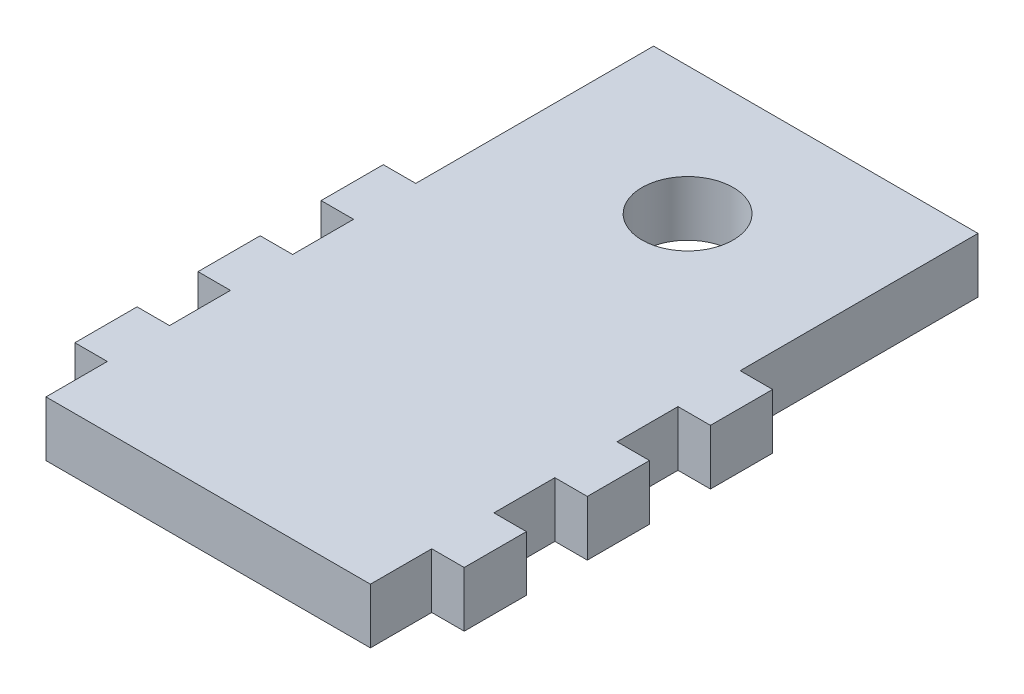
ISO-10303-21;
HEADER;
FILE_DESCRIPTION(('STEP AP214'),'2;1');
FILE_NAME('part.step','',(''),(''),'','','');
FILE_SCHEMA(('AUTOMOTIVE_DESIGN { 1 0 10303 214 1 1 1 1 }'));
ENDSEC;
DATA;
#1=APPLICATION_CONTEXT('core data for automotive mechanical design processes');
#2=APPLICATION_PROTOCOL_DEFINITION('international standard','automotive_design',2000,#1);
#3=PRODUCT_CONTEXT('',#1,'mechanical');
#4=PRODUCT('Part','Part','',(#3));
#5=PRODUCT_RELATED_PRODUCT_CATEGORY('part','',(#4));
#6=PRODUCT_DEFINITION_FORMATION('','',#4);
#7=PRODUCT_DEFINITION_CONTEXT('part definition',#1,'design');
#8=PRODUCT_DEFINITION('design','',#6,#7);
#9=PRODUCT_DEFINITION_SHAPE('','',#8);
#10=(LENGTH_UNIT() NAMED_UNIT(*) SI_UNIT(.MILLI.,.METRE.));
#11=(NAMED_UNIT(*) PLANE_ANGLE_UNIT() SI_UNIT($,.RADIAN.));
#12=(NAMED_UNIT(*) SI_UNIT($,.STERADIAN.) SOLID_ANGLE_UNIT());
#13=UNCERTAINTY_MEASURE_WITH_UNIT(LENGTH_MEASURE(1.E-05),#10,'distance_accuracy_value','');
#14=(GEOMETRIC_REPRESENTATION_CONTEXT(3) GLOBAL_UNCERTAINTY_ASSIGNED_CONTEXT((#13)) GLOBAL_UNIT_ASSIGNED_CONTEXT((#10,
#11,#12)) REPRESENTATION_CONTEXT('',''));
#15=CARTESIAN_POINT('',(0.,0.,0.));
#16=DIRECTION('',(0.,0.,1.));
#17=DIRECTION('',(1.,0.,0.));
#18=AXIS2_PLACEMENT_3D('',#15,#16,#17);
#19=CARTESIAN_POINT('',(-3.49862647297686,-70.5851324917423,-17.2482956808851));
#20=DIRECTION('',(0.,1.,0.));
#21=DIRECTION('',(0.,0.,1.));
#22=AXIS2_PLACEMENT_3D('',#19,#20,#21);
#23=CYLINDRICAL_SURFACE('',#22,4.45936);
#24=CARTESIAN_POINT('',(-3.49862647297686,0.,-17.2482956808851));
#25=DIRECTION('',(0.,1.,0.));
#26=DIRECTION('',(0.,0.,1.));
#27=AXIS2_PLACEMENT_3D('',#24,#25,#26);
#28=CIRCLE('',#27,4.45936);
#29=CARTESIAN_POINT('',(-3.49862647297686,0.,-12.7889356808851));
#30=VERTEX_POINT('',#29);
#31=EDGE_CURVE('E11',#30,#30,#28,.F.);
#32=ORIENTED_EDGE('',*,*,#31,.T.);
#33=EDGE_LOOP('',(#32));
#34=FACE_BOUND('',#33,.T.);
#35=CARTESIAN_POINT('',(-3.49862647297686,5.4,-17.2482956808851));
#36=DIRECTION('',(0.,1.,0.));
#37=DIRECTION('',(0.,0.,1.));
#38=AXIS2_PLACEMENT_3D('',#35,#36,#37);
#39=CIRCLE('',#38,4.45936);
#40=CARTESIAN_POINT('',(-3.49862647297686,5.4,-12.7889356808851));
#41=VERTEX_POINT('',#40);
#42=EDGE_CURVE('E256',#41,#41,#39,.T.);
#43=ORIENTED_EDGE('',*,*,#42,.T.);
#44=EDGE_LOOP('',(#43));
#45=FACE_BOUND('',#44,.T.);
#46=ADVANCED_FACE('F41',(#34,#45),#23,.F.);
#47=CARTESIAN_POINT('',(0.,0.,0.));
#48=DIRECTION('',(0.,1.,0.));
#49=DIRECTION('',(0.,0.,1.));
#50=AXIS2_PLACEMENT_3D('',#47,#48,#49);
#51=PLANE('',#50);
#52=DIRECTION('',(1.,0.,0.));
#53=VECTOR('',#52,1.);
#54=CARTESIAN_POINT('',(15.5420135270232,0.,-6.5246499665994));
#55=LINE('',#54,#53);
#56=CARTESIAN_POINT('',(12.3670135270231,0.,-6.5246499665994));
#57=VERTEX_POINT('',#56);
#58=CARTESIAN_POINT('',(15.5420135270232,0.,-6.5246499665994));
#59=VERTEX_POINT('',#58);
#60=EDGE_CURVE('E59',#57,#59,#55,.T.);
#61=ORIENTED_EDGE('',*,*,#60,.T.);
#62=DIRECTION('',(0.,0.,1.));
#63=VECTOR('',#62,1.);
#64=CARTESIAN_POINT('',(15.5420135270232,0.,-0.443369966599398));
#65=LINE('',#64,#63);
#66=CARTESIAN_POINT('',(15.5420135270232,0.,-0.443369966599398));
#67=VERTEX_POINT('',#66);
#68=EDGE_CURVE('E513',#59,#67,#65,.T.);
#69=ORIENTED_EDGE('',*,*,#68,.T.);
#70=DIRECTION('',(-1.,0.,0.));
#71=VECTOR('',#70,1.);
#72=CARTESIAN_POINT('',(12.3670135270231,0.,-0.443369966599398));
#73=LINE('',#72,#71);
#74=CARTESIAN_POINT('',(12.3670135270231,0.,-0.443369966599398));
#75=VERTEX_POINT('',#74);
#76=EDGE_CURVE('E510',#67,#75,#73,.T.);
#77=ORIENTED_EDGE('',*,*,#76,.T.);
#78=DIRECTION('',(0.,0.,1.));
#79=VECTOR('',#78,1.);
#80=CARTESIAN_POINT('',(12.3670135270231,0.,5.51820717625773));
#81=LINE('',#80,#79);
#82=CARTESIAN_POINT('',(12.3670135270231,0.,5.51820717625773));
#83=VERTEX_POINT('',#82);
#84=EDGE_CURVE('E507',#75,#83,#81,.T.);
#85=ORIENTED_EDGE('',*,*,#84,.T.);
#86=DIRECTION('',(1.,0.,0.));
#87=VECTOR('',#86,1.);
#88=CARTESIAN_POINT('',(15.5420135270232,0.,5.51820717625773));
#89=LINE('',#88,#87);
#90=CARTESIAN_POINT('',(15.5420135270232,0.,5.51820717625773));
#91=VERTEX_POINT('',#90);
#92=EDGE_CURVE('E504',#83,#91,#89,.T.);
#93=ORIENTED_EDGE('',*,*,#92,.T.);
#94=DIRECTION('',(0.,0.,1.));
#95=VECTOR('',#94,1.);
#96=CARTESIAN_POINT('',(15.5420135270232,0.,11.5994871762577));
#97=LINE('',#96,#95);
#98=CARTESIAN_POINT('',(15.5420135270232,0.,11.5994871762577));
#99=VERTEX_POINT('',#98);
#100=EDGE_CURVE('E501',#91,#99,#97,.T.);
#101=ORIENTED_EDGE('',*,*,#100,.T.);
#102=DIRECTION('',(-1.,0.,0.));
#103=VECTOR('',#102,1.);
#104=CARTESIAN_POINT('',(12.3670135270231,0.,11.5994871762577));
#105=LINE('',#104,#103);
#106=CARTESIAN_POINT('',(12.3670135270231,0.,11.5994871762577));
#107=VERTEX_POINT('',#106);
#108=EDGE_CURVE('E498',#99,#107,#105,.T.);
#109=ORIENTED_EDGE('',*,*,#108,.T.);
#110=DIRECTION('',(0.,0.,1.));
#111=VECTOR('',#110,1.);
#112=CARTESIAN_POINT('',(12.3670135270231,0.,17.5610643191149));
#113=LINE('',#112,#111);
#114=CARTESIAN_POINT('',(12.3670135270231,0.,17.5610643191149));
#115=VERTEX_POINT('',#114);
#116=EDGE_CURVE('E495',#107,#115,#113,.T.);
#117=ORIENTED_EDGE('',*,*,#116,.T.);
#118=DIRECTION('',(1.,0.,0.));
#119=VECTOR('',#118,1.);
#120=CARTESIAN_POINT('',(15.5420135270231,0.,17.5610643191149));
#121=LINE('',#120,#119);
#122=CARTESIAN_POINT('',(15.5420135270231,0.,17.5610643191149));
#123=VERTEX_POINT('',#122);
#124=EDGE_CURVE('E492',#115,#123,#121,.T.);
#125=ORIENTED_EDGE('',*,*,#124,.T.);
#126=DIRECTION('',(0.,0.,1.));
#127=VECTOR('',#126,1.);
#128=CARTESIAN_POINT('',(15.5420135270231,0.,23.6423443191149));
#129=LINE('',#128,#127);
#130=CARTESIAN_POINT('',(15.5420135270231,0.,23.6423443191149));
#131=VERTEX_POINT('',#130);
#132=EDGE_CURVE('E489',#123,#131,#129,.T.);
#133=ORIENTED_EDGE('',*,*,#132,.T.);
#134=DIRECTION('',(-1.,0.,0.));
#135=VECTOR('',#134,1.);
#136=CARTESIAN_POINT('',(12.3670135270231,0.,23.6423443191149));
#137=LINE('',#136,#135);
#138=CARTESIAN_POINT('',(12.3670135270231,0.,23.6423443191149));
#139=VERTEX_POINT('',#138);
#140=EDGE_CURVE('E486',#131,#139,#137,.T.);
#141=ORIENTED_EDGE('',*,*,#140,.T.);
#142=DIRECTION('',(0.,0.,1.));
#143=VECTOR('',#142,1.);
#144=CARTESIAN_POINT('',(12.3670135270231,0.,29.6423443191149));
#145=LINE('',#144,#143);
#146=CARTESIAN_POINT('',(12.3670135270231,0.,29.6423443191149));
#147=VERTEX_POINT('',#146);
#148=EDGE_CURVE('E483',#139,#147,#145,.T.);
#149=ORIENTED_EDGE('',*,*,#148,.T.);
#150=DIRECTION('',(-1.,0.,0.));
#151=VECTOR('',#150,1.);
#152=CARTESIAN_POINT('',(-19.3642664729769,0.,29.6423443191149));
#153=LINE('',#152,#151);
#154=CARTESIAN_POINT('',(-19.3642664729769,0.,29.6423443191149));
#155=VERTEX_POINT('',#154);
#156=EDGE_CURVE('E480',#147,#155,#153,.T.);
#157=ORIENTED_EDGE('',*,*,#156,.T.);
#158=DIRECTION('',(0.,0.,-1.));
#159=VECTOR('',#158,1.);
#160=CARTESIAN_POINT('',(-19.3642664729769,0.,23.6423443191149));
#161=LINE('',#160,#159);
#162=CARTESIAN_POINT('',(-19.3642664729769,0.,23.6423443191149));
#163=VERTEX_POINT('',#162);
#164=EDGE_CURVE('E477',#155,#163,#161,.T.);
#165=ORIENTED_EDGE('',*,*,#164,.T.);
#166=DIRECTION('',(-1.,0.,0.));
#167=VECTOR('',#166,1.);
#168=CARTESIAN_POINT('',(-22.5392664729769,0.,23.6423443191149));
#169=LINE('',#168,#167);
#170=CARTESIAN_POINT('',(-22.5392664729769,0.,23.6423443191149));
#171=VERTEX_POINT('',#170);
#172=EDGE_CURVE('E474',#163,#171,#169,.T.);
#173=ORIENTED_EDGE('',*,*,#172,.T.);
#174=DIRECTION('',(0.,0.,-1.));
#175=VECTOR('',#174,1.);
#176=CARTESIAN_POINT('',(-22.5392664729769,0.,17.5610643191149));
#177=LINE('',#176,#175);
#178=CARTESIAN_POINT('',(-22.5392664729769,0.,17.5610643191149));
#179=VERTEX_POINT('',#178);
#180=EDGE_CURVE('E471',#171,#179,#177,.T.);
#181=ORIENTED_EDGE('',*,*,#180,.T.);
#182=DIRECTION('',(1.,0.,0.));
#183=VECTOR('',#182,1.);
#184=CARTESIAN_POINT('',(-19.3642664729769,0.,17.5610643191149));
#185=LINE('',#184,#183);
#186=CARTESIAN_POINT('',(-19.3642664729769,0.,17.5610643191149));
#187=VERTEX_POINT('',#186);
#188=EDGE_CURVE('E468',#179,#187,#185,.T.);
#189=ORIENTED_EDGE('',*,*,#188,.T.);
#190=DIRECTION('',(0.,0.,-1.));
#191=VECTOR('',#190,1.);
#192=CARTESIAN_POINT('',(-19.3642664729769,0.,11.5994871762578));
#193=LINE('',#192,#191);
#194=CARTESIAN_POINT('',(-19.3642664729769,0.,11.5994871762578));
#195=VERTEX_POINT('',#194);
#196=EDGE_CURVE('E465',#187,#195,#193,.T.);
#197=ORIENTED_EDGE('',*,*,#196,.T.);
#198=DIRECTION('',(-1.,0.,0.));
#199=VECTOR('',#198,1.);
#200=CARTESIAN_POINT('',(-22.5392664729769,0.,11.5994871762578));
#201=LINE('',#200,#199);
#202=CARTESIAN_POINT('',(-22.5392664729769,0.,11.5994871762578));
#203=VERTEX_POINT('',#202);
#204=EDGE_CURVE('E462',#195,#203,#201,.T.);
#205=ORIENTED_EDGE('',*,*,#204,.T.);
#206=DIRECTION('',(0.,0.,-1.));
#207=VECTOR('',#206,1.);
#208=CARTESIAN_POINT('',(-22.5392664729769,0.,5.51820717625776));
#209=LINE('',#208,#207);
#210=CARTESIAN_POINT('',(-22.5392664729769,0.,5.51820717625776));
#211=VERTEX_POINT('',#210);
#212=EDGE_CURVE('E459',#203,#211,#209,.T.);
#213=ORIENTED_EDGE('',*,*,#212,.T.);
#214=DIRECTION('',(1.,0.,0.));
#215=VECTOR('',#214,1.);
#216=CARTESIAN_POINT('',(-19.3642664729769,0.,5.51820717625776));
#217=LINE('',#216,#215);
#218=CARTESIAN_POINT('',(-19.3642664729769,0.,5.51820717625776));
#219=VERTEX_POINT('',#218);
#220=EDGE_CURVE('E456',#211,#219,#217,.T.);
#221=ORIENTED_EDGE('',*,*,#220,.T.);
#222=DIRECTION('',(0.,0.,-1.));
#223=VECTOR('',#222,1.);
#224=CARTESIAN_POINT('',(-19.3642664729769,0.,-0.443369966599384));
#225=LINE('',#224,#223);
#226=CARTESIAN_POINT('',(-19.3642664729769,0.,-0.443369966599384));
#227=VERTEX_POINT('',#226);
#228=EDGE_CURVE('E453',#219,#227,#225,.T.);
#229=ORIENTED_EDGE('',*,*,#228,.T.);
#230=DIRECTION('',(-1.,0.,0.));
#231=VECTOR('',#230,1.);
#232=CARTESIAN_POINT('',(-22.5392664729769,0.,-0.443369966599384));
#233=LINE('',#232,#231);
#234=CARTESIAN_POINT('',(-22.5392664729769,0.,-0.443369966599384));
#235=VERTEX_POINT('',#234);
#236=EDGE_CURVE('E450',#227,#235,#233,.T.);
#237=ORIENTED_EDGE('',*,*,#236,.T.);
#238=DIRECTION('',(0.,0.,-1.));
#239=VECTOR('',#238,1.);
#240=CARTESIAN_POINT('',(-22.5392664729769,0.,-6.52464996659939));
#241=LINE('',#240,#239);
#242=CARTESIAN_POINT('',(-22.5392664729769,0.,-6.52464996659939));
#243=VERTEX_POINT('',#242);
#244=EDGE_CURVE('E447',#235,#243,#241,.T.);
#245=ORIENTED_EDGE('',*,*,#244,.T.);
#246=DIRECTION('',(1.,0.,0.));
#247=VECTOR('',#246,1.);
#248=CARTESIAN_POINT('',(-19.3642664729769,0.,-6.52464996659939));
#249=LINE('',#248,#247);
#250=CARTESIAN_POINT('',(-19.3642664729769,0.,-6.52464996659939));
#251=VERTEX_POINT('',#250);
#252=EDGE_CURVE('E444',#243,#251,#249,.T.);
#253=ORIENTED_EDGE('',*,*,#252,.T.);
#254=DIRECTION('',(0.,0.,-1.));
#255=VECTOR('',#254,1.);
#256=CARTESIAN_POINT('',(-19.3642664729769,0.,-29.7889356808851));
#257=LINE('',#256,#255);
#258=CARTESIAN_POINT('',(-19.3642664729769,0.,-29.7889356808851));
#259=VERTEX_POINT('',#258);
#260=EDGE_CURVE('E138',#251,#259,#257,.T.);
#261=ORIENTED_EDGE('',*,*,#260,.T.);
#262=DIRECTION('',(1.,0.,0.));
#263=VECTOR('',#262,1.);
#264=CARTESIAN_POINT('',(12.3670135270231,0.,-29.7889356808851));
#265=LINE('',#264,#263);
#266=CARTESIAN_POINT('',(12.3670135270231,0.,-29.7889356808851));
#267=VERTEX_POINT('',#266);
#268=EDGE_CURVE('E142',#259,#267,#265,.T.);
#269=ORIENTED_EDGE('',*,*,#268,.T.);
#270=DIRECTION('',(0.,0.,1.));
#271=VECTOR('',#270,1.);
#272=CARTESIAN_POINT('',(12.3670135270231,0.,-6.5246499665994));
#273=LINE('',#272,#271);
#274=EDGE_CURVE('E51',#267,#57,#273,.T.);
#275=ORIENTED_EDGE('',*,*,#274,.T.);
#276=EDGE_LOOP('',(#61,#69,#77,#85,#93,#101,#109,#117,#125,#133,#141,#149,#157,#165,#173,#181,
#189,#197,#205,#213,#221,#229,#237,#245,#253,#261,#269,#275));
#277=FACE_BOUND('',#276,.T.);
#278=ORIENTED_EDGE('',*,*,#31,.F.);
#279=EDGE_LOOP('',(#278));
#280=FACE_BOUND('',#279,.T.);
#281=ADVANCED_FACE('F43',(#277,#280),#51,.F.);
#282=CARTESIAN_POINT('',(12.3670135270231,-70.5851324917423,-6.5246499665994));
#283=DIRECTION('',(1.,0.,0.));
#284=DIRECTION('',(0.,0.,-1.));
#285=AXIS2_PLACEMENT_3D('',#282,#283,#284);
#286=PLANE('',#285);
#287=ORIENTED_EDGE('',*,*,#274,.F.);
#288=DIRECTION('',(0.,1.,0.));
#289=VECTOR('',#288,1.);
#290=CARTESIAN_POINT('',(12.3670135270231,-70.5851324917423,-29.7889356808851));
#291=LINE('',#290,#289);
#292=CARTESIAN_POINT('',(12.3670135270231,5.4,-29.7889356808851));
#293=VERTEX_POINT('',#292);
#294=EDGE_CURVE('E241',#267,#293,#291,.T.);
#295=ORIENTED_EDGE('',*,*,#294,.T.);
#296=DIRECTION('',(0.,0.,-1.));
#297=VECTOR('',#296,1.);
#298=CARTESIAN_POINT('',(12.3670135270231,5.4,-6.5246499665994));
#299=LINE('',#298,#297);
#300=CARTESIAN_POINT('',(12.3670135270231,5.4,-6.5246499665994));
#301=VERTEX_POINT('',#300);
#302=EDGE_CURVE('E244',#301,#293,#299,.T.);
#303=ORIENTED_EDGE('',*,*,#302,.F.);
#304=DIRECTION('',(0.,1.,0.));
#305=VECTOR('',#304,1.);
#306=CARTESIAN_POINT('',(12.3670135270231,-70.5851324917423,-6.5246499665994));
#307=LINE('',#306,#305);
#308=EDGE_CURVE('E233',#57,#301,#307,.T.);
#309=ORIENTED_EDGE('',*,*,#308,.F.);
#310=EDGE_LOOP('',(#287,#295,#303,#309));
#311=FACE_BOUND('',#310,.T.);
#312=ADVANCED_FACE('F245',(#311),#286,.T.);
#313=CARTESIAN_POINT('',(12.3670135270231,-70.5851324917423,-29.7889356808851));
#314=DIRECTION('',(0.,0.,-1.));
#315=DIRECTION('',(-1.,0.,0.));
#316=AXIS2_PLACEMENT_3D('',#313,#314,#315);
#317=PLANE('',#316);
#318=ORIENTED_EDGE('',*,*,#268,.F.);
#319=DIRECTION('',(0.,1.,0.));
#320=VECTOR('',#319,1.);
#321=CARTESIAN_POINT('',(-19.3642664729769,-70.5851324917423,-29.7889356808851));
#322=LINE('',#321,#320);
#323=CARTESIAN_POINT('',(-19.3642664729769,5.4,-29.7889356808851));
#324=VERTEX_POINT('',#323);
#325=EDGE_CURVE('E436',#259,#324,#322,.T.);
#326=ORIENTED_EDGE('',*,*,#325,.T.);
#327=DIRECTION('',(-1.,0.,0.));
#328=VECTOR('',#327,1.);
#329=CARTESIAN_POINT('',(12.3670135270231,5.4,-29.7889356808851));
#330=LINE('',#329,#328);
#331=EDGE_CURVE('E250',#293,#324,#330,.T.);
#332=ORIENTED_EDGE('',*,*,#331,.F.);
#333=ORIENTED_EDGE('',*,*,#294,.F.);
#334=EDGE_LOOP('',(#318,#326,#332,#333));
#335=FACE_BOUND('',#334,.T.);
#336=ADVANCED_FACE('F552',(#335),#317,.T.);
#337=CARTESIAN_POINT('',(-19.3642664729769,-70.5851324917423,-29.7889356808851));
#338=DIRECTION('',(-1.,0.,0.));
#339=DIRECTION('',(0.,0.,1.));
#340=AXIS2_PLACEMENT_3D('',#337,#338,#339);
#341=PLANE('',#340);
#342=ORIENTED_EDGE('',*,*,#260,.F.);
#343=DIRECTION('',(0.,1.,0.));
#344=VECTOR('',#343,1.);
#345=CARTESIAN_POINT('',(-19.3642664729769,-70.5851324917423,-6.52464996659939));
#346=LINE('',#345,#344);
#347=CARTESIAN_POINT('',(-19.3642664729769,5.4,-6.52464996659939));
#348=VERTEX_POINT('',#347);
#349=EDGE_CURVE('E433',#251,#348,#346,.T.);
#350=ORIENTED_EDGE('',*,*,#349,.T.);
#351=DIRECTION('',(0.,0.,1.));
#352=VECTOR('',#351,1.);
#353=CARTESIAN_POINT('',(-19.3642664729769,5.4,-29.7889356808851));
#354=LINE('',#353,#352);
#355=EDGE_CURVE('E265',#324,#348,#354,.T.);
#356=ORIENTED_EDGE('',*,*,#355,.F.);
#357=ORIENTED_EDGE('',*,*,#325,.F.);
#358=EDGE_LOOP('',(#342,#350,#356,#357));
#359=FACE_BOUND('',#358,.T.);
#360=ADVANCED_FACE('F555',(#359),#341,.T.);
#361=CARTESIAN_POINT('',(-19.3642664729769,-70.5851324917423,-6.52464996659939));
#362=DIRECTION('',(0.,0.,-1.));
#363=DIRECTION('',(-1.,0.,0.));
#364=AXIS2_PLACEMENT_3D('',#361,#362,#363);
#365=PLANE('',#364);
#366=ORIENTED_EDGE('',*,*,#252,.F.);
#367=DIRECTION('',(0.,1.,0.));
#368=VECTOR('',#367,1.);
#369=CARTESIAN_POINT('',(-22.5392664729769,-70.5851324917423,-6.52464996659939));
#370=LINE('',#369,#368);
#371=CARTESIAN_POINT('',(-22.5392664729769,5.4,-6.52464996659939));
#372=VERTEX_POINT('',#371);
#373=EDGE_CURVE('E430',#243,#372,#370,.T.);
#374=ORIENTED_EDGE('',*,*,#373,.T.);
#375=DIRECTION('',(-1.,0.,0.));
#376=VECTOR('',#375,1.);
#377=CARTESIAN_POINT('',(-19.3642664729769,5.4,-6.52464996659939));
#378=LINE('',#377,#376);
#379=EDGE_CURVE('E269',#348,#372,#378,.T.);
#380=ORIENTED_EDGE('',*,*,#379,.F.);
#381=ORIENTED_EDGE('',*,*,#349,.F.);
#382=EDGE_LOOP('',(#366,#374,#380,#381));
#383=FACE_BOUND('',#382,.T.);
#384=ADVANCED_FACE('F559',(#383),#365,.T.);
#385=CARTESIAN_POINT('',(-22.5392664729769,-70.5851324917423,-6.52464996659939));
#386=DIRECTION('',(-1.,0.,0.));
#387=DIRECTION('',(0.,0.,1.));
#388=AXIS2_PLACEMENT_3D('',#385,#386,#387);
#389=PLANE('',#388);
#390=ORIENTED_EDGE('',*,*,#244,.F.);
#391=DIRECTION('',(0.,1.,0.));
#392=VECTOR('',#391,1.);
#393=CARTESIAN_POINT('',(-22.5392664729769,-70.5851324917423,-0.443369966599384));
#394=LINE('',#393,#392);
#395=CARTESIAN_POINT('',(-22.5392664729769,5.4,-0.443369966599384));
#396=VERTEX_POINT('',#395);
#397=EDGE_CURVE('E427',#235,#396,#394,.T.);
#398=ORIENTED_EDGE('',*,*,#397,.T.);
#399=DIRECTION('',(0.,0.,1.));
#400=VECTOR('',#399,1.);
#401=CARTESIAN_POINT('',(-22.5392664729769,5.4,-6.52464996659939));
#402=LINE('',#401,#400);
#403=EDGE_CURVE('E273',#372,#396,#402,.T.);
#404=ORIENTED_EDGE('',*,*,#403,.F.);
#405=ORIENTED_EDGE('',*,*,#373,.F.);
#406=EDGE_LOOP('',(#390,#398,#404,#405));
#407=FACE_BOUND('',#406,.T.);
#408=ADVANCED_FACE('F563',(#407),#389,.T.);
#409=CARTESIAN_POINT('',(-22.5392664729769,-70.5851324917423,-0.443369966599384));
#410=DIRECTION('',(0.,0.,1.));
#411=DIRECTION('',(1.,0.,0.));
#412=AXIS2_PLACEMENT_3D('',#409,#410,#411);
#413=PLANE('',#412);
#414=ORIENTED_EDGE('',*,*,#236,.F.);
#415=DIRECTION('',(0.,1.,0.));
#416=VECTOR('',#415,1.);
#417=CARTESIAN_POINT('',(-19.3642664729769,-70.5851324917423,-0.443369966599384));
#418=LINE('',#417,#416);
#419=CARTESIAN_POINT('',(-19.3642664729769,5.4,-0.443369966599384));
#420=VERTEX_POINT('',#419);
#421=EDGE_CURVE('E424',#227,#420,#418,.T.);
#422=ORIENTED_EDGE('',*,*,#421,.T.);
#423=DIRECTION('',(1.,0.,0.));
#424=VECTOR('',#423,1.);
#425=CARTESIAN_POINT('',(-22.5392664729769,5.4,-0.443369966599384));
#426=LINE('',#425,#424);
#427=EDGE_CURVE('E277',#396,#420,#426,.T.);
#428=ORIENTED_EDGE('',*,*,#427,.F.);
#429=ORIENTED_EDGE('',*,*,#397,.F.);
#430=EDGE_LOOP('',(#414,#422,#428,#429));
#431=FACE_BOUND('',#430,.T.);
#432=ADVANCED_FACE('F567',(#431),#413,.T.);
#433=CARTESIAN_POINT('',(-19.3642664729769,-70.5851324917423,-0.443369966599384));
#434=DIRECTION('',(-1.,0.,0.));
#435=DIRECTION('',(0.,0.,1.));
#436=AXIS2_PLACEMENT_3D('',#433,#434,#435);
#437=PLANE('',#436);
#438=ORIENTED_EDGE('',*,*,#228,.F.);
#439=DIRECTION('',(0.,1.,0.));
#440=VECTOR('',#439,1.);
#441=CARTESIAN_POINT('',(-19.3642664729769,-70.5851324917423,5.51820717625776));
#442=LINE('',#441,#440);
#443=CARTESIAN_POINT('',(-19.3642664729769,5.4,5.51820717625776));
#444=VERTEX_POINT('',#443);
#445=EDGE_CURVE('E421',#219,#444,#442,.T.);
#446=ORIENTED_EDGE('',*,*,#445,.T.);
#447=DIRECTION('',(0.,0.,1.));
#448=VECTOR('',#447,1.);
#449=CARTESIAN_POINT('',(-19.3642664729769,5.4,-0.443369966599384));
#450=LINE('',#449,#448);
#451=EDGE_CURVE('E281',#420,#444,#450,.T.);
#452=ORIENTED_EDGE('',*,*,#451,.F.);
#453=ORIENTED_EDGE('',*,*,#421,.F.);
#454=EDGE_LOOP('',(#438,#446,#452,#453));
#455=FACE_BOUND('',#454,.T.);
#456=ADVANCED_FACE('F571',(#455),#437,.T.);
#457=CARTESIAN_POINT('',(-19.3642664729769,-70.5851324917423,5.51820717625776));
#458=DIRECTION('',(0.,0.,-1.));
#459=DIRECTION('',(-1.,0.,0.));
#460=AXIS2_PLACEMENT_3D('',#457,#458,#459);
#461=PLANE('',#460);
#462=ORIENTED_EDGE('',*,*,#220,.F.);
#463=DIRECTION('',(0.,1.,0.));
#464=VECTOR('',#463,1.);
#465=CARTESIAN_POINT('',(-22.5392664729769,-70.5851324917423,5.51820717625776));
#466=LINE('',#465,#464);
#467=CARTESIAN_POINT('',(-22.5392664729769,5.4,5.51820717625776));
#468=VERTEX_POINT('',#467);
#469=EDGE_CURVE('E418',#211,#468,#466,.T.);
#470=ORIENTED_EDGE('',*,*,#469,.T.);
#471=DIRECTION('',(-1.,0.,0.));
#472=VECTOR('',#471,1.);
#473=CARTESIAN_POINT('',(-19.3642664729769,5.4,5.51820717625776));
#474=LINE('',#473,#472);
#475=EDGE_CURVE('E285',#444,#468,#474,.T.);
#476=ORIENTED_EDGE('',*,*,#475,.F.);
#477=ORIENTED_EDGE('',*,*,#445,.F.);
#478=EDGE_LOOP('',(#462,#470,#476,#477));
#479=FACE_BOUND('',#478,.T.);
#480=ADVANCED_FACE('F575',(#479),#461,.T.);
#481=CARTESIAN_POINT('',(-22.5392664729769,-70.5851324917423,5.51820717625776));
#482=DIRECTION('',(-1.,0.,0.));
#483=DIRECTION('',(0.,0.,1.));
#484=AXIS2_PLACEMENT_3D('',#481,#482,#483);
#485=PLANE('',#484);
#486=ORIENTED_EDGE('',*,*,#212,.F.);
#487=DIRECTION('',(0.,1.,0.));
#488=VECTOR('',#487,1.);
#489=CARTESIAN_POINT('',(-22.5392664729769,-70.5851324917423,11.5994871762578));
#490=LINE('',#489,#488);
#491=CARTESIAN_POINT('',(-22.5392664729769,5.4,11.5994871762578));
#492=VERTEX_POINT('',#491);
#493=EDGE_CURVE('E415',#203,#492,#490,.T.);
#494=ORIENTED_EDGE('',*,*,#493,.T.);
#495=DIRECTION('',(0.,0.,1.));
#496=VECTOR('',#495,1.);
#497=CARTESIAN_POINT('',(-22.5392664729769,5.4,5.51820717625776));
#498=LINE('',#497,#496);
#499=EDGE_CURVE('E289',#468,#492,#498,.T.);
#500=ORIENTED_EDGE('',*,*,#499,.F.);
#501=ORIENTED_EDGE('',*,*,#469,.F.);
#502=EDGE_LOOP('',(#486,#494,#500,#501));
#503=FACE_BOUND('',#502,.T.);
#504=ADVANCED_FACE('F579',(#503),#485,.T.);
#505=CARTESIAN_POINT('',(-22.5392664729769,-70.5851324917423,11.5994871762578));
#506=DIRECTION('',(0.,0.,1.));
#507=DIRECTION('',(1.,0.,0.));
#508=AXIS2_PLACEMENT_3D('',#505,#506,#507);
#509=PLANE('',#508);
#510=ORIENTED_EDGE('',*,*,#204,.F.);
#511=DIRECTION('',(0.,1.,0.));
#512=VECTOR('',#511,1.);
#513=CARTESIAN_POINT('',(-19.3642664729769,-70.5851324917423,11.5994871762578));
#514=LINE('',#513,#512);
#515=CARTESIAN_POINT('',(-19.3642664729769,5.4,11.5994871762578));
#516=VERTEX_POINT('',#515);
#517=EDGE_CURVE('E412',#195,#516,#514,.T.);
#518=ORIENTED_EDGE('',*,*,#517,.T.);
#519=DIRECTION('',(1.,0.,0.));
#520=VECTOR('',#519,1.);
#521=CARTESIAN_POINT('',(-22.5392664729769,5.4,11.5994871762578));
#522=LINE('',#521,#520);
#523=EDGE_CURVE('E293',#492,#516,#522,.T.);
#524=ORIENTED_EDGE('',*,*,#523,.F.);
#525=ORIENTED_EDGE('',*,*,#493,.F.);
#526=EDGE_LOOP('',(#510,#518,#524,#525));
#527=FACE_BOUND('',#526,.T.);
#528=ADVANCED_FACE('F583',(#527),#509,.T.);
#529=CARTESIAN_POINT('',(-19.3642664729769,-70.5851324917423,11.5994871762578));
#530=DIRECTION('',(-1.,0.,0.));
#531=DIRECTION('',(0.,0.,1.));
#532=AXIS2_PLACEMENT_3D('',#529,#530,#531);
#533=PLANE('',#532);
#534=ORIENTED_EDGE('',*,*,#196,.F.);
#535=DIRECTION('',(0.,1.,0.));
#536=VECTOR('',#535,1.);
#537=CARTESIAN_POINT('',(-19.3642664729769,-70.5851324917423,17.5610643191149));
#538=LINE('',#537,#536);
#539=CARTESIAN_POINT('',(-19.3642664729769,5.4,17.5610643191149));
#540=VERTEX_POINT('',#539);
#541=EDGE_CURVE('E409',#187,#540,#538,.T.);
#542=ORIENTED_EDGE('',*,*,#541,.T.);
#543=DIRECTION('',(0.,0.,1.));
#544=VECTOR('',#543,1.);
#545=CARTESIAN_POINT('',(-19.3642664729769,5.4,11.5994871762578));
#546=LINE('',#545,#544);
#547=EDGE_CURVE('E297',#516,#540,#546,.T.);
#548=ORIENTED_EDGE('',*,*,#547,.F.);
#549=ORIENTED_EDGE('',*,*,#517,.F.);
#550=EDGE_LOOP('',(#534,#542,#548,#549));
#551=FACE_BOUND('',#550,.T.);
#552=ADVANCED_FACE('F587',(#551),#533,.T.);
#553=CARTESIAN_POINT('',(-19.3642664729769,-70.5851324917423,17.5610643191149));
#554=DIRECTION('',(0.,0.,-1.));
#555=DIRECTION('',(-1.,0.,0.));
#556=AXIS2_PLACEMENT_3D('',#553,#554,#555);
#557=PLANE('',#556);
#558=ORIENTED_EDGE('',*,*,#188,.F.);
#559=DIRECTION('',(0.,1.,0.));
#560=VECTOR('',#559,1.);
#561=CARTESIAN_POINT('',(-22.5392664729769,-70.5851324917423,17.5610643191149));
#562=LINE('',#561,#560);
#563=CARTESIAN_POINT('',(-22.5392664729769,5.4,17.5610643191149));
#564=VERTEX_POINT('',#563);
#565=EDGE_CURVE('E406',#179,#564,#562,.T.);
#566=ORIENTED_EDGE('',*,*,#565,.T.);
#567=DIRECTION('',(-1.,0.,0.));
#568=VECTOR('',#567,1.);
#569=CARTESIAN_POINT('',(-19.3642664729769,5.4,17.5610643191149));
#570=LINE('',#569,#568);
#571=EDGE_CURVE('E301',#540,#564,#570,.T.);
#572=ORIENTED_EDGE('',*,*,#571,.F.);
#573=ORIENTED_EDGE('',*,*,#541,.F.);
#574=EDGE_LOOP('',(#558,#566,#572,#573));
#575=FACE_BOUND('',#574,.T.);
#576=ADVANCED_FACE('F591',(#575),#557,.T.);
#577=CARTESIAN_POINT('',(-22.5392664729769,-70.5851324917423,17.5610643191149));
#578=DIRECTION('',(-1.,0.,0.));
#579=DIRECTION('',(0.,0.,1.));
#580=AXIS2_PLACEMENT_3D('',#577,#578,#579);
#581=PLANE('',#580);
#582=ORIENTED_EDGE('',*,*,#180,.F.);
#583=DIRECTION('',(0.,1.,0.));
#584=VECTOR('',#583,1.);
#585=CARTESIAN_POINT('',(-22.5392664729769,-70.5851324917423,23.6423443191149));
#586=LINE('',#585,#584);
#587=CARTESIAN_POINT('',(-22.5392664729769,5.4,23.6423443191149));
#588=VERTEX_POINT('',#587);
#589=EDGE_CURVE('E403',#171,#588,#586,.T.);
#590=ORIENTED_EDGE('',*,*,#589,.T.);
#591=DIRECTION('',(0.,0.,1.));
#592=VECTOR('',#591,1.);
#593=CARTESIAN_POINT('',(-22.5392664729769,5.4,17.5610643191149));
#594=LINE('',#593,#592);
#595=EDGE_CURVE('E305',#564,#588,#594,.T.);
#596=ORIENTED_EDGE('',*,*,#595,.F.);
#597=ORIENTED_EDGE('',*,*,#565,.F.);
#598=EDGE_LOOP('',(#582,#590,#596,#597));
#599=FACE_BOUND('',#598,.T.);
#600=ADVANCED_FACE('F595',(#599),#581,.T.);
#601=CARTESIAN_POINT('',(-22.5392664729769,-70.5851324917423,23.6423443191149));
#602=DIRECTION('',(0.,0.,1.));
#603=DIRECTION('',(1.,0.,0.));
#604=AXIS2_PLACEMENT_3D('',#601,#602,#603);
#605=PLANE('',#604);
#606=ORIENTED_EDGE('',*,*,#172,.F.);
#607=DIRECTION('',(0.,1.,0.));
#608=VECTOR('',#607,1.);
#609=CARTESIAN_POINT('',(-19.3642664729769,-70.5851324917423,23.6423443191149));
#610=LINE('',#609,#608);
#611=CARTESIAN_POINT('',(-19.3642664729769,5.4,23.6423443191149));
#612=VERTEX_POINT('',#611);
#613=EDGE_CURVE('E400',#163,#612,#610,.T.);
#614=ORIENTED_EDGE('',*,*,#613,.T.);
#615=DIRECTION('',(1.,0.,0.));
#616=VECTOR('',#615,1.);
#617=CARTESIAN_POINT('',(-22.5392664729769,5.4,23.6423443191149));
#618=LINE('',#617,#616);
#619=EDGE_CURVE('E309',#588,#612,#618,.T.);
#620=ORIENTED_EDGE('',*,*,#619,.F.);
#621=ORIENTED_EDGE('',*,*,#589,.F.);
#622=EDGE_LOOP('',(#606,#614,#620,#621));
#623=FACE_BOUND('',#622,.T.);
#624=ADVANCED_FACE('F599',(#623),#605,.T.);
#625=CARTESIAN_POINT('',(-19.3642664729769,-70.5851324917423,23.6423443191149));
#626=DIRECTION('',(-1.,0.,0.));
#627=DIRECTION('',(0.,0.,1.));
#628=AXIS2_PLACEMENT_3D('',#625,#626,#627);
#629=PLANE('',#628);
#630=ORIENTED_EDGE('',*,*,#164,.F.);
#631=DIRECTION('',(0.,1.,0.));
#632=VECTOR('',#631,1.);
#633=CARTESIAN_POINT('',(-19.3642664729769,-70.5851324917423,29.6423443191149));
#634=LINE('',#633,#632);
#635=CARTESIAN_POINT('',(-19.3642664729769,5.4,29.6423443191149));
#636=VERTEX_POINT('',#635);
#637=EDGE_CURVE('E397',#155,#636,#634,.T.);
#638=ORIENTED_EDGE('',*,*,#637,.T.);
#639=DIRECTION('',(0.,0.,1.));
#640=VECTOR('',#639,1.);
#641=CARTESIAN_POINT('',(-19.3642664729769,5.4,23.6423443191149));
#642=LINE('',#641,#640);
#643=EDGE_CURVE('E313',#612,#636,#642,.T.);
#644=ORIENTED_EDGE('',*,*,#643,.F.);
#645=ORIENTED_EDGE('',*,*,#613,.F.);
#646=EDGE_LOOP('',(#630,#638,#644,#645));
#647=FACE_BOUND('',#646,.T.);
#648=ADVANCED_FACE('F603',(#647),#629,.T.);
#649=CARTESIAN_POINT('',(-19.3642664729769,-70.5851324917423,29.6423443191149));
#650=DIRECTION('',(0.,0.,1.));
#651=DIRECTION('',(1.,0.,0.));
#652=AXIS2_PLACEMENT_3D('',#649,#650,#651);
#653=PLANE('',#652);
#654=ORIENTED_EDGE('',*,*,#156,.F.);
#655=DIRECTION('',(0.,1.,0.));
#656=VECTOR('',#655,1.);
#657=CARTESIAN_POINT('',(12.3670135270231,-70.5851324917423,29.6423443191149));
#658=LINE('',#657,#656);
#659=CARTESIAN_POINT('',(12.3670135270231,5.4,29.6423443191149));
#660=VERTEX_POINT('',#659);
#661=EDGE_CURVE('E394',#147,#660,#658,.T.);
#662=ORIENTED_EDGE('',*,*,#661,.T.);
#663=DIRECTION('',(1.,0.,0.));
#664=VECTOR('',#663,1.);
#665=CARTESIAN_POINT('',(-19.3642664729769,5.4,29.6423443191149));
#666=LINE('',#665,#664);
#667=EDGE_CURVE('E317',#636,#660,#666,.T.);
#668=ORIENTED_EDGE('',*,*,#667,.F.);
#669=ORIENTED_EDGE('',*,*,#637,.F.);
#670=EDGE_LOOP('',(#654,#662,#668,#669));
#671=FACE_BOUND('',#670,.T.);
#672=ADVANCED_FACE('F607',(#671),#653,.T.);
#673=CARTESIAN_POINT('',(12.3670135270231,-70.5851324917423,29.6423443191149));
#674=DIRECTION('',(1.,0.,0.));
#675=DIRECTION('',(0.,0.,-1.));
#676=AXIS2_PLACEMENT_3D('',#673,#674,#675);
#677=PLANE('',#676);
#678=ORIENTED_EDGE('',*,*,#148,.F.);
#679=DIRECTION('',(0.,1.,0.));
#680=VECTOR('',#679,1.);
#681=CARTESIAN_POINT('',(12.3670135270231,-70.5851324917423,23.6423443191149));
#682=LINE('',#681,#680);
#683=CARTESIAN_POINT('',(12.3670135270231,5.4,23.6423443191149));
#684=VERTEX_POINT('',#683);
#685=EDGE_CURVE('E391',#139,#684,#682,.T.);
#686=ORIENTED_EDGE('',*,*,#685,.T.);
#687=DIRECTION('',(0.,0.,-1.));
#688=VECTOR('',#687,1.);
#689=CARTESIAN_POINT('',(12.3670135270231,5.4,29.6423443191149));
#690=LINE('',#689,#688);
#691=EDGE_CURVE('E321',#660,#684,#690,.T.);
#692=ORIENTED_EDGE('',*,*,#691,.F.);
#693=ORIENTED_EDGE('',*,*,#661,.F.);
#694=EDGE_LOOP('',(#678,#686,#692,#693));
#695=FACE_BOUND('',#694,.T.);
#696=ADVANCED_FACE('F611',(#695),#677,.T.);
#697=CARTESIAN_POINT('',(12.3670135270231,-70.5851324917423,23.6423443191149));
#698=DIRECTION('',(0.,0.,1.));
#699=DIRECTION('',(1.,0.,0.));
#700=AXIS2_PLACEMENT_3D('',#697,#698,#699);
#701=PLANE('',#700);
#702=ORIENTED_EDGE('',*,*,#140,.F.);
#703=DIRECTION('',(0.,1.,0.));
#704=VECTOR('',#703,1.);
#705=CARTESIAN_POINT('',(15.5420135270231,-70.5851324917423,23.6423443191149));
#706=LINE('',#705,#704);
#707=CARTESIAN_POINT('',(15.5420135270231,5.4,23.6423443191149));
#708=VERTEX_POINT('',#707);
#709=EDGE_CURVE('E388',#131,#708,#706,.T.);
#710=ORIENTED_EDGE('',*,*,#709,.T.);
#711=DIRECTION('',(1.,0.,0.));
#712=VECTOR('',#711,1.);
#713=CARTESIAN_POINT('',(12.3670135270231,5.4,23.6423443191149));
#714=LINE('',#713,#712);
#715=EDGE_CURVE('E325',#684,#708,#714,.T.);
#716=ORIENTED_EDGE('',*,*,#715,.F.);
#717=ORIENTED_EDGE('',*,*,#685,.F.);
#718=EDGE_LOOP('',(#702,#710,#716,#717));
#719=FACE_BOUND('',#718,.T.);
#720=ADVANCED_FACE('F615',(#719),#701,.T.);
#721=CARTESIAN_POINT('',(15.5420135270231,-70.5851324917423,23.6423443191149));
#722=DIRECTION('',(1.,0.,0.));
#723=DIRECTION('',(0.,0.,-1.));
#724=AXIS2_PLACEMENT_3D('',#721,#722,#723);
#725=PLANE('',#724);
#726=ORIENTED_EDGE('',*,*,#132,.F.);
#727=DIRECTION('',(0.,1.,0.));
#728=VECTOR('',#727,1.);
#729=CARTESIAN_POINT('',(15.5420135270231,-70.5851324917423,17.5610643191149));
#730=LINE('',#729,#728);
#731=CARTESIAN_POINT('',(15.5420135270231,5.4,17.5610643191149));
#732=VERTEX_POINT('',#731);
#733=EDGE_CURVE('E385',#123,#732,#730,.T.);
#734=ORIENTED_EDGE('',*,*,#733,.T.);
#735=DIRECTION('',(0.,0.,-1.));
#736=VECTOR('',#735,1.);
#737=CARTESIAN_POINT('',(15.5420135270231,5.4,23.6423443191149));
#738=LINE('',#737,#736);
#739=EDGE_CURVE('E329',#708,#732,#738,.T.);
#740=ORIENTED_EDGE('',*,*,#739,.F.);
#741=ORIENTED_EDGE('',*,*,#709,.F.);
#742=EDGE_LOOP('',(#726,#734,#740,#741));
#743=FACE_BOUND('',#742,.T.);
#744=ADVANCED_FACE('F619',(#743),#725,.T.);
#745=CARTESIAN_POINT('',(15.5420135270231,-70.5851324917423,17.5610643191149));
#746=DIRECTION('',(0.,0.,-1.));
#747=DIRECTION('',(-1.,0.,0.));
#748=AXIS2_PLACEMENT_3D('',#745,#746,#747);
#749=PLANE('',#748);
#750=ORIENTED_EDGE('',*,*,#124,.F.);
#751=DIRECTION('',(0.,1.,0.));
#752=VECTOR('',#751,1.);
#753=CARTESIAN_POINT('',(12.3670135270231,-70.5851324917423,17.5610643191149));
#754=LINE('',#753,#752);
#755=CARTESIAN_POINT('',(12.3670135270231,5.4,17.5610643191149));
#756=VERTEX_POINT('',#755);
#757=EDGE_CURVE('E382',#115,#756,#754,.T.);
#758=ORIENTED_EDGE('',*,*,#757,.T.);
#759=DIRECTION('',(-1.,0.,0.));
#760=VECTOR('',#759,1.);
#761=CARTESIAN_POINT('',(15.5420135270231,5.4,17.5610643191149));
#762=LINE('',#761,#760);
#763=EDGE_CURVE('E333',#732,#756,#762,.T.);
#764=ORIENTED_EDGE('',*,*,#763,.F.);
#765=ORIENTED_EDGE('',*,*,#733,.F.);
#766=EDGE_LOOP('',(#750,#758,#764,#765));
#767=FACE_BOUND('',#766,.T.);
#768=ADVANCED_FACE('F623',(#767),#749,.T.);
#769=CARTESIAN_POINT('',(12.3670135270231,-70.5851324917423,17.5610643191149));
#770=DIRECTION('',(1.,0.,0.));
#771=DIRECTION('',(0.,0.,-1.));
#772=AXIS2_PLACEMENT_3D('',#769,#770,#771);
#773=PLANE('',#772);
#774=ORIENTED_EDGE('',*,*,#116,.F.);
#775=DIRECTION('',(0.,1.,0.));
#776=VECTOR('',#775,1.);
#777=CARTESIAN_POINT('',(12.3670135270231,-70.5851324917423,11.5994871762577));
#778=LINE('',#777,#776);
#779=CARTESIAN_POINT('',(12.3670135270231,5.4,11.5994871762577));
#780=VERTEX_POINT('',#779);
#781=EDGE_CURVE('E379',#107,#780,#778,.T.);
#782=ORIENTED_EDGE('',*,*,#781,.T.);
#783=DIRECTION('',(0.,0.,-1.));
#784=VECTOR('',#783,1.);
#785=CARTESIAN_POINT('',(12.3670135270231,5.4,17.5610643191149));
#786=LINE('',#785,#784);
#787=EDGE_CURVE('E337',#756,#780,#786,.T.);
#788=ORIENTED_EDGE('',*,*,#787,.F.);
#789=ORIENTED_EDGE('',*,*,#757,.F.);
#790=EDGE_LOOP('',(#774,#782,#788,#789));
#791=FACE_BOUND('',#790,.T.);
#792=ADVANCED_FACE('F627',(#791),#773,.T.);
#793=CARTESIAN_POINT('',(12.3670135270231,-70.5851324917423,11.5994871762577));
#794=DIRECTION('',(0.,0.,1.));
#795=DIRECTION('',(1.,0.,0.));
#796=AXIS2_PLACEMENT_3D('',#793,#794,#795);
#797=PLANE('',#796);
#798=ORIENTED_EDGE('',*,*,#108,.F.);
#799=DIRECTION('',(0.,1.,0.));
#800=VECTOR('',#799,1.);
#801=CARTESIAN_POINT('',(15.5420135270232,-70.5851324917423,11.5994871762577));
#802=LINE('',#801,#800);
#803=CARTESIAN_POINT('',(15.5420135270232,5.4,11.5994871762577));
#804=VERTEX_POINT('',#803);
#805=EDGE_CURVE('E376',#99,#804,#802,.T.);
#806=ORIENTED_EDGE('',*,*,#805,.T.);
#807=DIRECTION('',(1.,0.,0.));
#808=VECTOR('',#807,1.);
#809=CARTESIAN_POINT('',(12.3670135270231,5.4,11.5994871762577));
#810=LINE('',#809,#808);
#811=EDGE_CURVE('E341',#780,#804,#810,.T.);
#812=ORIENTED_EDGE('',*,*,#811,.F.);
#813=ORIENTED_EDGE('',*,*,#781,.F.);
#814=EDGE_LOOP('',(#798,#806,#812,#813));
#815=FACE_BOUND('',#814,.T.);
#816=ADVANCED_FACE('F631',(#815),#797,.T.);
#817=CARTESIAN_POINT('',(15.5420135270232,-70.5851324917423,11.5994871762577));
#818=DIRECTION('',(1.,0.,0.));
#819=DIRECTION('',(0.,0.,-1.));
#820=AXIS2_PLACEMENT_3D('',#817,#818,#819);
#821=PLANE('',#820);
#822=ORIENTED_EDGE('',*,*,#100,.F.);
#823=DIRECTION('',(0.,1.,0.));
#824=VECTOR('',#823,1.);
#825=CARTESIAN_POINT('',(15.5420135270232,-70.5851324917423,5.51820717625773));
#826=LINE('',#825,#824);
#827=CARTESIAN_POINT('',(15.5420135270232,5.4,5.51820717625773));
#828=VERTEX_POINT('',#827);
#829=EDGE_CURVE('E373',#91,#828,#826,.T.);
#830=ORIENTED_EDGE('',*,*,#829,.T.);
#831=DIRECTION('',(0.,0.,-1.));
#832=VECTOR('',#831,1.);
#833=CARTESIAN_POINT('',(15.5420135270232,5.4,11.5994871762577));
#834=LINE('',#833,#832);
#835=EDGE_CURVE('E345',#804,#828,#834,.T.);
#836=ORIENTED_EDGE('',*,*,#835,.F.);
#837=ORIENTED_EDGE('',*,*,#805,.F.);
#838=EDGE_LOOP('',(#822,#830,#836,#837));
#839=FACE_BOUND('',#838,.T.);
#840=ADVANCED_FACE('F635',(#839),#821,.T.);
#841=CARTESIAN_POINT('',(15.5420135270232,-70.5851324917423,5.51820717625773));
#842=DIRECTION('',(0.,0.,-1.));
#843=DIRECTION('',(-1.,0.,0.));
#844=AXIS2_PLACEMENT_3D('',#841,#842,#843);
#845=PLANE('',#844);
#846=ORIENTED_EDGE('',*,*,#92,.F.);
#847=DIRECTION('',(0.,1.,0.));
#848=VECTOR('',#847,1.);
#849=CARTESIAN_POINT('',(12.3670135270231,-70.5851324917423,5.51820717625773));
#850=LINE('',#849,#848);
#851=CARTESIAN_POINT('',(12.3670135270231,5.4,5.51820717625773));
#852=VERTEX_POINT('',#851);
#853=EDGE_CURVE('E370',#83,#852,#850,.T.);
#854=ORIENTED_EDGE('',*,*,#853,.T.);
#855=DIRECTION('',(-1.,0.,0.));
#856=VECTOR('',#855,1.);
#857=CARTESIAN_POINT('',(15.5420135270232,5.4,5.51820717625773));
#858=LINE('',#857,#856);
#859=EDGE_CURVE('E349',#828,#852,#858,.T.);
#860=ORIENTED_EDGE('',*,*,#859,.F.);
#861=ORIENTED_EDGE('',*,*,#829,.F.);
#862=EDGE_LOOP('',(#846,#854,#860,#861));
#863=FACE_BOUND('',#862,.T.);
#864=ADVANCED_FACE('F639',(#863),#845,.T.);
#865=CARTESIAN_POINT('',(12.3670135270231,-70.5851324917423,5.51820717625773));
#866=DIRECTION('',(1.,0.,0.));
#867=DIRECTION('',(0.,0.,-1.));
#868=AXIS2_PLACEMENT_3D('',#865,#866,#867);
#869=PLANE('',#868);
#870=ORIENTED_EDGE('',*,*,#84,.F.);
#871=DIRECTION('',(0.,1.,0.));
#872=VECTOR('',#871,1.);
#873=CARTESIAN_POINT('',(12.3670135270231,-70.5851324917423,-0.443369966599398));
#874=LINE('',#873,#872);
#875=CARTESIAN_POINT('',(12.3670135270231,5.4,-0.443369966599398));
#876=VERTEX_POINT('',#875);
#877=EDGE_CURVE('E367',#75,#876,#874,.T.);
#878=ORIENTED_EDGE('',*,*,#877,.T.);
#879=DIRECTION('',(0.,0.,-1.));
#880=VECTOR('',#879,1.);
#881=CARTESIAN_POINT('',(12.3670135270231,5.4,5.51820717625773));
#882=LINE('',#881,#880);
#883=EDGE_CURVE('E353',#852,#876,#882,.T.);
#884=ORIENTED_EDGE('',*,*,#883,.F.);
#885=ORIENTED_EDGE('',*,*,#853,.F.);
#886=EDGE_LOOP('',(#870,#878,#884,#885));
#887=FACE_BOUND('',#886,.T.);
#888=ADVANCED_FACE('F535',(#887),#869,.T.);
#889=CARTESIAN_POINT('',(12.3670135270231,-70.5851324917423,-0.443369966599398));
#890=DIRECTION('',(0.,0.,1.));
#891=DIRECTION('',(1.,0.,0.));
#892=AXIS2_PLACEMENT_3D('',#889,#890,#891);
#893=PLANE('',#892);
#894=ORIENTED_EDGE('',*,*,#76,.F.);
#895=DIRECTION('',(0.,1.,0.));
#896=VECTOR('',#895,1.);
#897=CARTESIAN_POINT('',(15.5420135270232,-70.5851324917423,-0.443369966599398));
#898=LINE('',#897,#896);
#899=CARTESIAN_POINT('',(15.5420135270232,5.4,-0.443369966599398));
#900=VERTEX_POINT('',#899);
#901=EDGE_CURVE('E364',#67,#900,#898,.T.);
#902=ORIENTED_EDGE('',*,*,#901,.T.);
#903=DIRECTION('',(1.,0.,0.));
#904=VECTOR('',#903,1.);
#905=CARTESIAN_POINT('',(12.3670135270231,5.4,-0.443369966599398));
#906=LINE('',#905,#904);
#907=EDGE_CURVE('E357',#876,#900,#906,.T.);
#908=ORIENTED_EDGE('',*,*,#907,.F.);
#909=ORIENTED_EDGE('',*,*,#877,.F.);
#910=EDGE_LOOP('',(#894,#902,#908,#909));
#911=FACE_BOUND('',#910,.T.);
#912=ADVANCED_FACE('F525',(#911),#893,.T.);
#913=CARTESIAN_POINT('',(15.5420135270232,-70.5851324917423,-0.443369966599398));
#914=DIRECTION('',(1.,0.,0.));
#915=DIRECTION('',(0.,0.,-1.));
#916=AXIS2_PLACEMENT_3D('',#913,#914,#915);
#917=PLANE('',#916);
#918=ORIENTED_EDGE('',*,*,#68,.F.);
#919=DIRECTION('',(0.,1.,0.));
#920=VECTOR('',#919,1.);
#921=CARTESIAN_POINT('',(15.5420135270232,-70.5851324917423,-6.5246499665994));
#922=LINE('',#921,#920);
#923=CARTESIAN_POINT('',(15.5420135270232,5.4,-6.5246499665994));
#924=VERTEX_POINT('',#923);
#925=EDGE_CURVE('E149',#59,#924,#922,.T.);
#926=ORIENTED_EDGE('',*,*,#925,.T.);
#927=DIRECTION('',(0.,0.,-1.));
#928=VECTOR('',#927,1.);
#929=CARTESIAN_POINT('',(15.5420135270232,5.4,-0.443369966599398));
#930=LINE('',#929,#928);
#931=EDGE_CURVE('E242',#900,#924,#930,.T.);
#932=ORIENTED_EDGE('',*,*,#931,.F.);
#933=ORIENTED_EDGE('',*,*,#901,.F.);
#934=EDGE_LOOP('',(#918,#926,#932,#933));
#935=FACE_BOUND('',#934,.T.);
#936=ADVANCED_FACE('F527',(#935),#917,.T.);
#937=CARTESIAN_POINT('',(15.5420135270232,-70.5851324917423,-6.5246499665994));
#938=DIRECTION('',(0.,0.,-1.));
#939=DIRECTION('',(-1.,0.,0.));
#940=AXIS2_PLACEMENT_3D('',#937,#938,#939);
#941=PLANE('',#940);
#942=ORIENTED_EDGE('',*,*,#60,.F.);
#943=ORIENTED_EDGE('',*,*,#308,.T.);
#944=DIRECTION('',(-1.,0.,0.));
#945=VECTOR('',#944,1.);
#946=CARTESIAN_POINT('',(15.5420135270232,5.4,-6.5246499665994));
#947=LINE('',#946,#945);
#948=EDGE_CURVE('E237',#924,#301,#947,.T.);
#949=ORIENTED_EDGE('',*,*,#948,.F.);
#950=ORIENTED_EDGE('',*,*,#925,.F.);
#951=EDGE_LOOP('',(#942,#943,#949,#950));
#952=FACE_BOUND('',#951,.T.);
#953=ADVANCED_FACE('F235',(#952),#941,.T.);
#954=CARTESIAN_POINT('',(0.,5.4,0.));
#955=DIRECTION('',(0.,1.,0.));
#956=DIRECTION('',(0.,0.,1.));
#957=AXIS2_PLACEMENT_3D('',#954,#955,#956);
#958=PLANE('',#957);
#959=ORIENTED_EDGE('',*,*,#948,.T.);
#960=ORIENTED_EDGE('',*,*,#302,.T.);
#961=ORIENTED_EDGE('',*,*,#331,.T.);
#962=ORIENTED_EDGE('',*,*,#355,.T.);
#963=ORIENTED_EDGE('',*,*,#379,.T.);
#964=ORIENTED_EDGE('',*,*,#403,.T.);
#965=ORIENTED_EDGE('',*,*,#427,.T.);
#966=ORIENTED_EDGE('',*,*,#451,.T.);
#967=ORIENTED_EDGE('',*,*,#475,.T.);
#968=ORIENTED_EDGE('',*,*,#499,.T.);
#969=ORIENTED_EDGE('',*,*,#523,.T.);
#970=ORIENTED_EDGE('',*,*,#547,.T.);
#971=ORIENTED_EDGE('',*,*,#571,.T.);
#972=ORIENTED_EDGE('',*,*,#595,.T.);
#973=ORIENTED_EDGE('',*,*,#619,.T.);
#974=ORIENTED_EDGE('',*,*,#643,.T.);
#975=ORIENTED_EDGE('',*,*,#667,.T.);
#976=ORIENTED_EDGE('',*,*,#691,.T.);
#977=ORIENTED_EDGE('',*,*,#715,.T.);
#978=ORIENTED_EDGE('',*,*,#739,.T.);
#979=ORIENTED_EDGE('',*,*,#763,.T.);
#980=ORIENTED_EDGE('',*,*,#787,.T.);
#981=ORIENTED_EDGE('',*,*,#811,.T.);
#982=ORIENTED_EDGE('',*,*,#835,.T.);
#983=ORIENTED_EDGE('',*,*,#859,.T.);
#984=ORIENTED_EDGE('',*,*,#883,.T.);
#985=ORIENTED_EDGE('',*,*,#907,.T.);
#986=ORIENTED_EDGE('',*,*,#931,.T.);
#987=EDGE_LOOP('',(#959,#960,#961,#962,#963,#964,#965,#966,#967,#968,#969,#970,#971,#972,#973,
#974,#975,#976,#977,#978,#979,#980,#981,#982,#983,#984,#985,#986));
#988=FACE_BOUND('',#987,.T.);
#989=ORIENTED_EDGE('',*,*,#42,.F.);
#990=EDGE_LOOP('',(#989));
#991=FACE_BOUND('',#990,.T.);
#992=ADVANCED_FACE('F252',(#988,#991),#958,.T.);
#993=CLOSED_SHELL('',(#46,#281,#312,#336,#360,#384,#408,#432,#456,#480,#504,#528,#552,#576,#600,
#624,#648,#672,#696,#720,#744,#768,#792,#816,#840,#864,#888,#912,#936,#953,#992));
#994=MANIFOLD_SOLID_BREP('B2',#993);
#995=ADVANCED_BREP_SHAPE_REPRESENTATION('',(#18,#994),#14);
#996=SHAPE_DEFINITION_REPRESENTATION(#9,#995);
ENDSEC;
END-ISO-10303-21;
